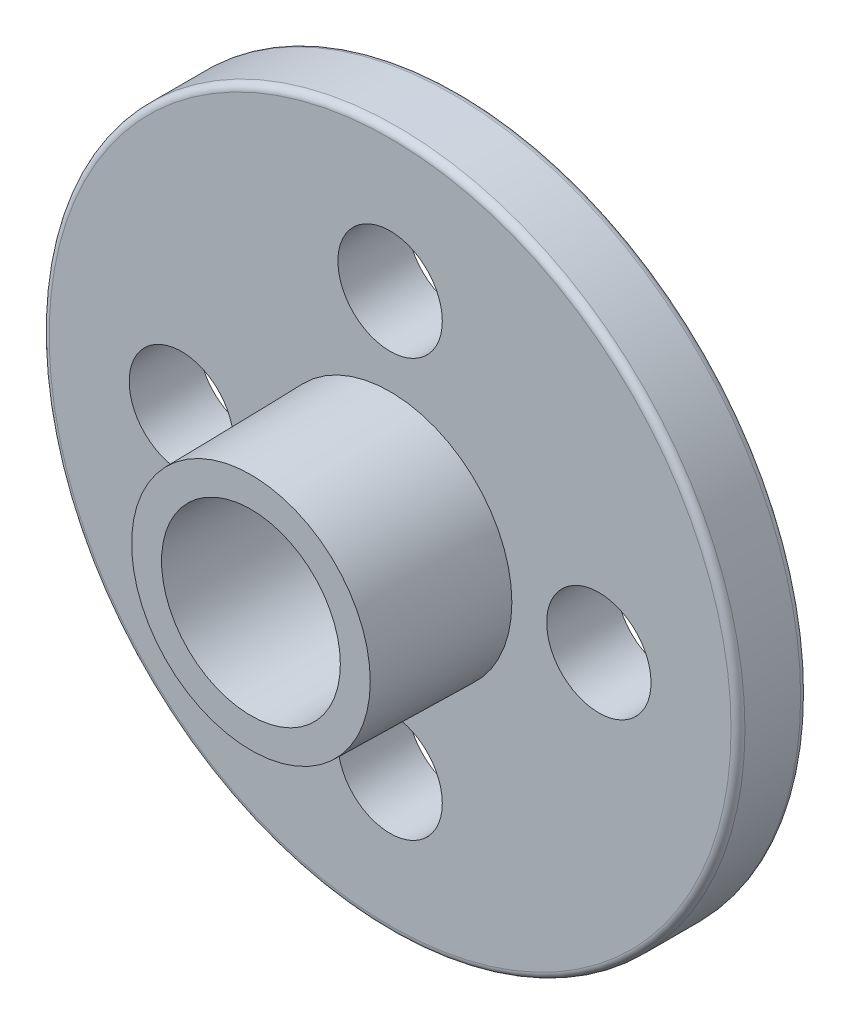
ISO-10303-21;
HEADER;
FILE_DESCRIPTION(('STEP AP214'),'2;1');
FILE_NAME('part.step','',(''),(''),'','','');
FILE_SCHEMA(('AUTOMOTIVE_DESIGN { 1 0 10303 214 1 1 1 1 }'));
ENDSEC;
DATA;
#1=APPLICATION_CONTEXT('core data for automotive mechanical design processes');
#2=APPLICATION_PROTOCOL_DEFINITION('international standard','automotive_design',2000,#1);
#3=PRODUCT_CONTEXT('',#1,'mechanical');
#4=PRODUCT('Part','Part','',(#3));
#5=PRODUCT_RELATED_PRODUCT_CATEGORY('part','',(#4));
#6=PRODUCT_DEFINITION_FORMATION('','',#4);
#7=PRODUCT_DEFINITION_CONTEXT('part definition',#1,'design');
#8=PRODUCT_DEFINITION('design','',#6,#7);
#9=PRODUCT_DEFINITION_SHAPE('','',#8);
#10=(LENGTH_UNIT() NAMED_UNIT(*) SI_UNIT(.MILLI.,.METRE.));
#11=(NAMED_UNIT(*) PLANE_ANGLE_UNIT() SI_UNIT($,.RADIAN.));
#12=(NAMED_UNIT(*) SI_UNIT($,.STERADIAN.) SOLID_ANGLE_UNIT());
#13=UNCERTAINTY_MEASURE_WITH_UNIT(LENGTH_MEASURE(1.E-05),#10,'distance_accuracy_value','');
#14=(GEOMETRIC_REPRESENTATION_CONTEXT(3) GLOBAL_UNCERTAINTY_ASSIGNED_CONTEXT((#13)) GLOBAL_UNIT_ASSIGNED_CONTEXT((#10,
#11,#12)) REPRESENTATION_CONTEXT('',''));
#15=CARTESIAN_POINT('',(0.,0.,0.));
#16=DIRECTION('',(0.,0.,1.));
#17=DIRECTION('',(1.,0.,0.));
#18=AXIS2_PLACEMENT_3D('',#15,#16,#17);
#19=CARTESIAN_POINT('',(0.,0.,2.));
#20=DIRECTION('',(0.,0.,1.));
#21=DIRECTION('',(1.,0.,0.));
#22=AXIS2_PLACEMENT_3D('',#19,#20,#21);
#23=PLANE('',#22);
#24=CARTESIAN_POINT('',(0.,0.,2.));
#25=DIRECTION('',(0.,0.,1.));
#26=DIRECTION('',(1.,0.,0.));
#27=AXIS2_PLACEMENT_3D('',#24,#25,#26);
#28=CIRCLE('',#27,3.5);
#29=CARTESIAN_POINT('',(3.5,0.,2.));
#30=VERTEX_POINT('',#29);
#31=EDGE_CURVE('E89',#30,#30,#28,.T.);
#32=ORIENTED_EDGE('',*,*,#31,.F.);
#33=EDGE_LOOP('',(#32));
#34=FACE_BOUND('',#33,.T.);
#35=CARTESIAN_POINT('',(0.,0.,2.));
#36=DIRECTION('',(0.,0.,1.));
#37=DIRECTION('',(1.,0.,0.));
#38=AXIS2_PLACEMENT_3D('',#35,#36,#37);
#39=CIRCLE('',#38,9.8);
#40=CARTESIAN_POINT('',(9.8,0.,2.));
#41=VERTEX_POINT('',#40);
#42=EDGE_CURVE('E46',#41,#41,#39,.T.);
#43=ORIENTED_EDGE('',*,*,#42,.T.);
#44=EDGE_LOOP('',(#43));
#45=FACE_BOUND('',#44,.T.);
#46=CARTESIAN_POINT('',(3.39346007646042E-13,-6.,2.));
#47=DIRECTION('',(0.,0.,1.));
#48=DIRECTION('',(1.,0.,0.));
#49=AXIS2_PLACEMENT_3D('',#46,#47,#48);
#50=CIRCLE('',#49,1.50000000000037);
#51=CARTESIAN_POINT('',(1.5000000000007,-6.,2.));
#52=VERTEX_POINT('',#51);
#53=EDGE_CURVE('E71',#52,#52,#50,.T.);
#54=ORIENTED_EDGE('',*,*,#53,.F.);
#55=EDGE_LOOP('',(#54));
#56=FACE_BOUND('',#55,.T.);
#57=CARTESIAN_POINT('',(0.,6.,2.));
#58=DIRECTION('',(0.,0.,1.));
#59=DIRECTION('',(1.,0.,0.));
#60=AXIS2_PLACEMENT_3D('',#57,#58,#59);
#61=CIRCLE('',#60,1.5);
#62=CARTESIAN_POINT('',(1.5,6.,2.));
#63=VERTEX_POINT('',#62);
#64=EDGE_CURVE('E61',#63,#63,#61,.T.);
#65=ORIENTED_EDGE('',*,*,#64,.F.);
#66=EDGE_LOOP('',(#65));
#67=FACE_BOUND('',#66,.T.);
#68=CARTESIAN_POINT('',(6.00000000000017,1.69428074463191E-13,2.));
#69=DIRECTION('',(0.,0.,1.));
#70=DIRECTION('',(1.,0.,0.));
#71=AXIS2_PLACEMENT_3D('',#68,#69,#70);
#72=CIRCLE('',#71,1.50000000000013);
#73=CARTESIAN_POINT('',(7.5000000000003,1.69428074463191E-13,2.));
#74=VERTEX_POINT('',#73);
#75=EDGE_CURVE('E65',#74,#74,#72,.T.);
#76=ORIENTED_EDGE('',*,*,#75,.F.);
#77=EDGE_LOOP('',(#76));
#78=FACE_BOUND('',#77,.T.);
#79=CARTESIAN_POINT('',(-5.99999999999983,-1.7016286254268E-13,2.));
#80=DIRECTION('',(0.,0.,1.));
#81=DIRECTION('',(1.,0.,0.));
#82=AXIS2_PLACEMENT_3D('',#79,#80,#81);
#83=CIRCLE('',#82,1.50000000000027);
#84=CARTESIAN_POINT('',(-4.49999999999956,-1.7016286254268E-13,2.));
#85=VERTEX_POINT('',#84);
#86=EDGE_CURVE('E77',#85,#85,#83,.T.);
#87=ORIENTED_EDGE('',*,*,#86,.F.);
#88=EDGE_LOOP('',(#87));
#89=FACE_BOUND('',#88,.T.);
#90=ADVANCED_FACE('F38',(#34,#45,#56,#67,#78,#89),#23,.T.);
#91=CARTESIAN_POINT('',(0.,0.,0.));
#92=DIRECTION('',(0.,0.,1.));
#93=DIRECTION('',(1.,0.,0.));
#94=AXIS2_PLACEMENT_3D('',#91,#92,#93);
#95=PLANE('',#94);
#96=CARTESIAN_POINT('',(0.,0.,0.));
#97=DIRECTION('',(0.,0.,-1.));
#98=DIRECTION('',(-1.,0.,0.));
#99=AXIS2_PLACEMENT_3D('',#96,#97,#98);
#100=CIRCLE('',#99,1.5);
#101=CARTESIAN_POINT('',(-1.5,0.,0.));
#102=VERTEX_POINT('',#101);
#103=EDGE_CURVE('E94',#102,#102,#100,.T.);
#104=ORIENTED_EDGE('',*,*,#103,.F.);
#105=EDGE_LOOP('',(#104));
#106=FACE_BOUND('',#105,.T.);
#107=CARTESIAN_POINT('',(0.,0.,0.));
#108=DIRECTION('',(0.,0.,1.));
#109=DIRECTION('',(1.,0.,0.));
#110=AXIS2_PLACEMENT_3D('',#107,#108,#109);
#111=CIRCLE('',#110,9.8);
#112=CARTESIAN_POINT('',(9.8,0.,0.));
#113=VERTEX_POINT('',#112);
#114=EDGE_CURVE('E50',#113,#113,#111,.F.);
#115=ORIENTED_EDGE('',*,*,#114,.T.);
#116=EDGE_LOOP('',(#115));
#117=FACE_BOUND('',#116,.T.);
#118=CARTESIAN_POINT('',(0.,6.,0.));
#119=DIRECTION('',(0.,0.,1.));
#120=DIRECTION('',(1.,0.,0.));
#121=AXIS2_PLACEMENT_3D('',#118,#119,#120);
#122=CIRCLE('',#121,1.5);
#123=CARTESIAN_POINT('',(1.5,6.,0.));
#124=VERTEX_POINT('',#123);
#125=EDGE_CURVE('E62',#124,#124,#122,.T.);
#126=ORIENTED_EDGE('',*,*,#125,.T.);
#127=EDGE_LOOP('',(#126));
#128=FACE_BOUND('',#127,.T.);
#129=CARTESIAN_POINT('',(6.00000000000017,1.69428074463191E-13,0.));
#130=DIRECTION('',(0.,0.,1.));
#131=DIRECTION('',(1.,0.,0.));
#132=AXIS2_PLACEMENT_3D('',#129,#130,#131);
#133=CIRCLE('',#132,1.50000000000013);
#134=CARTESIAN_POINT('',(7.5000000000003,1.69428074463191E-13,0.));
#135=VERTEX_POINT('',#134);
#136=EDGE_CURVE('E68',#135,#135,#133,.T.);
#137=ORIENTED_EDGE('',*,*,#136,.T.);
#138=EDGE_LOOP('',(#137));
#139=FACE_BOUND('',#138,.T.);
#140=CARTESIAN_POINT('',(3.39346007646042E-13,-6.,0.));
#141=DIRECTION('',(0.,0.,1.));
#142=DIRECTION('',(1.,0.,0.));
#143=AXIS2_PLACEMENT_3D('',#140,#141,#142);
#144=CIRCLE('',#143,1.50000000000037);
#145=CARTESIAN_POINT('',(1.5000000000007,-6.,0.));
#146=VERTEX_POINT('',#145);
#147=EDGE_CURVE('E74',#146,#146,#144,.T.);
#148=ORIENTED_EDGE('',*,*,#147,.T.);
#149=EDGE_LOOP('',(#148));
#150=FACE_BOUND('',#149,.T.);
#151=CARTESIAN_POINT('',(-5.99999999999983,-1.7016286254268E-13,0.));
#152=DIRECTION('',(0.,0.,1.));
#153=DIRECTION('',(1.,0.,0.));
#154=AXIS2_PLACEMENT_3D('',#151,#152,#153);
#155=CIRCLE('',#154,1.50000000000027);
#156=CARTESIAN_POINT('',(-4.49999999999956,-1.7016286254268E-13,0.));
#157=VERTEX_POINT('',#156);
#158=EDGE_CURVE('E80',#157,#157,#155,.T.);
#159=ORIENTED_EDGE('',*,*,#158,.T.);
#160=EDGE_LOOP('',(#159));
#161=FACE_BOUND('',#160,.T.);
#162=ADVANCED_FACE('F119',(#106,#117,#128,#139,#150,#161),#95,.F.);
#163=CARTESIAN_POINT('',(0.,0.,2.));
#164=DIRECTION('',(0.,0.,-1.));
#165=DIRECTION('',(-1.,0.,0.));
#166=AXIS2_PLACEMENT_3D('',#163,#164,#165);
#167=CYLINDRICAL_SURFACE('',#166,10.);
#168=CARTESIAN_POINT('',(0.,0.,0.2));
#169=DIRECTION('',(0.,0.,1.));
#170=DIRECTION('',(1.,0.,0.));
#171=AXIS2_PLACEMENT_3D('',#168,#169,#170);
#172=CIRCLE('',#171,10.);
#173=CARTESIAN_POINT('',(10.,0.,0.2));
#174=VERTEX_POINT('',#173);
#175=EDGE_CURVE('E55',#174,#174,#172,.T.);
#176=ORIENTED_EDGE('',*,*,#175,.T.);
#177=EDGE_LOOP('',(#176));
#178=FACE_BOUND('',#177,.T.);
#179=CARTESIAN_POINT('',(0.,0.,1.8));
#180=DIRECTION('',(0.,0.,1.));
#181=DIRECTION('',(1.,0.,0.));
#182=AXIS2_PLACEMENT_3D('',#179,#180,#181);
#183=CIRCLE('',#182,10.);
#184=CARTESIAN_POINT('',(10.,0.,1.8));
#185=VERTEX_POINT('',#184);
#186=EDGE_CURVE('E58',#185,#185,#183,.F.);
#187=ORIENTED_EDGE('',*,*,#186,.T.);
#188=EDGE_LOOP('',(#187));
#189=FACE_BOUND('',#188,.T.);
#190=ADVANCED_FACE('F124',(#178,#189),#167,.T.);
#191=CARTESIAN_POINT('',(0.,6.,2.));
#192=DIRECTION('',(0.,0.,-1.));
#193=DIRECTION('',(-1.,0.,0.));
#194=AXIS2_PLACEMENT_3D('',#191,#192,#193);
#195=CYLINDRICAL_SURFACE('',#194,1.5);
#196=ORIENTED_EDGE('',*,*,#64,.T.);
#197=EDGE_LOOP('',(#196));
#198=FACE_BOUND('',#197,.T.);
#199=ORIENTED_EDGE('',*,*,#125,.F.);
#200=EDGE_LOOP('',(#199));
#201=FACE_BOUND('',#200,.T.);
#202=ADVANCED_FACE('F157',(#198,#201),#195,.F.);
#203=CARTESIAN_POINT('',(6.00000000000017,1.69428074463191E-13,2.));
#204=DIRECTION('',(0.,0.,-1.));
#205=DIRECTION('',(-1.,0.,0.));
#206=AXIS2_PLACEMENT_3D('',#203,#204,#205);
#207=CYLINDRICAL_SURFACE('',#206,1.50000000000013);
#208=ORIENTED_EDGE('',*,*,#75,.T.);
#209=EDGE_LOOP('',(#208));
#210=FACE_BOUND('',#209,.T.);
#211=ORIENTED_EDGE('',*,*,#136,.F.);
#212=EDGE_LOOP('',(#211));
#213=FACE_BOUND('',#212,.T.);
#214=ADVANCED_FACE('F151',(#210,#213),#207,.F.);
#215=CARTESIAN_POINT('',(3.39346007646042E-13,-6.,2.));
#216=DIRECTION('',(0.,0.,-1.));
#217=DIRECTION('',(-1.,0.,0.));
#218=AXIS2_PLACEMENT_3D('',#215,#216,#217);
#219=CYLINDRICAL_SURFACE('',#218,1.50000000000037);
#220=ORIENTED_EDGE('',*,*,#53,.T.);
#221=EDGE_LOOP('',(#220));
#222=FACE_BOUND('',#221,.T.);
#223=ORIENTED_EDGE('',*,*,#147,.F.);
#224=EDGE_LOOP('',(#223));
#225=FACE_BOUND('',#224,.T.);
#226=ADVANCED_FACE('F142',(#222,#225),#219,.F.);
#227=CARTESIAN_POINT('',(-5.99999999999983,-1.7016286254268E-13,2.));
#228=DIRECTION('',(0.,0.,-1.));
#229=DIRECTION('',(-1.,0.,0.));
#230=AXIS2_PLACEMENT_3D('',#227,#228,#229);
#231=CYLINDRICAL_SURFACE('',#230,1.50000000000027);
#232=ORIENTED_EDGE('',*,*,#86,.T.);
#233=EDGE_LOOP('',(#232));
#234=FACE_BOUND('',#233,.T.);
#235=ORIENTED_EDGE('',*,*,#158,.F.);
#236=EDGE_LOOP('',(#235));
#237=FACE_BOUND('',#236,.T.);
#238=ADVANCED_FACE('F138',(#234,#237),#231,.F.);
#239=CARTESIAN_POINT('',(0.,0.,0.2));
#240=DIRECTION('',(0.,0.,1.));
#241=DIRECTION('',(1.,0.,0.));
#242=AXIS2_PLACEMENT_3D('',#239,#240,#241);
#243=TOROIDAL_SURFACE('',#242,9.8,0.2);
#244=ORIENTED_EDGE('',*,*,#114,.F.);
#245=EDGE_LOOP('',(#244));
#246=FACE_BOUND('',#245,.T.);
#247=ORIENTED_EDGE('',*,*,#175,.F.);
#248=EDGE_LOOP('',(#247));
#249=FACE_BOUND('',#248,.T.);
#250=ADVANCED_FACE('F141',(#246,#249),#243,.T.);
#251=CARTESIAN_POINT('',(0.,0.,1.8));
#252=DIRECTION('',(0.,0.,1.));
#253=DIRECTION('',(1.,0.,0.));
#254=AXIS2_PLACEMENT_3D('',#251,#252,#253);
#255=TOROIDAL_SURFACE('',#254,9.8,0.2);
#256=ORIENTED_EDGE('',*,*,#186,.F.);
#257=EDGE_LOOP('',(#256));
#258=FACE_BOUND('',#257,.T.);
#259=ORIENTED_EDGE('',*,*,#42,.F.);
#260=EDGE_LOOP('',(#259));
#261=FACE_BOUND('',#260,.T.);
#262=ADVANCED_FACE('F40',(#258,#261),#255,.T.);
#263=CARTESIAN_POINT('',(0.,0.,6.));
#264=DIRECTION('',(0.,0.,1.));
#265=DIRECTION('',(1.,0.,0.));
#266=AXIS2_PLACEMENT_3D('',#263,#264,#265);
#267=PLANE('',#266);
#268=CARTESIAN_POINT('',(0.,0.,6.));
#269=DIRECTION('',(0.,0.,1.));
#270=DIRECTION('',(1.,0.,0.));
#271=AXIS2_PLACEMENT_3D('',#268,#269,#270);
#272=CIRCLE('',#271,3.43017974028713);
#273=CARTESIAN_POINT('',(3.43017974028713,0.,6.));
#274=VERTEX_POINT('',#273);
#275=EDGE_CURVE('E83',#274,#274,#272,.T.);
#276=ORIENTED_EDGE('',*,*,#275,.T.);
#277=EDGE_LOOP('',(#276));
#278=FACE_BOUND('',#277,.T.);
#279=CARTESIAN_POINT('',(0.,0.,6.));
#280=DIRECTION('',(0.,0.,1.));
#281=DIRECTION('',(1.,0.,0.));
#282=AXIS2_PLACEMENT_3D('',#279,#280,#281);
#283=CIRCLE('',#282,2.56982025971287);
#284=CARTESIAN_POINT('',(2.56982025971287,0.,6.));
#285=VERTEX_POINT('',#284);
#286=EDGE_CURVE('E86',#285,#285,#283,.T.);
#287=ORIENTED_EDGE('',*,*,#286,.F.);
#288=EDGE_LOOP('',(#287));
#289=FACE_BOUND('',#288,.T.);
#290=ADVANCED_FACE('F183',(#278,#289),#267,.T.);
#291=CARTESIAN_POINT('',(0.,0.,2.));
#292=DIRECTION('',(0.,0.,-1.));
#293=DIRECTION('',(1.,0.,0.));
#294=AXIS2_PLACEMENT_3D('',#291,#292,#293);
#295=CONICAL_SURFACE('',#294,3.5,0.0174532925199433);
#296=ORIENTED_EDGE('',*,*,#275,.F.);
#297=EDGE_LOOP('',(#296));
#298=FACE_BOUND('',#297,.T.);
#299=ORIENTED_EDGE('',*,*,#31,.T.);
#300=EDGE_LOOP('',(#299));
#301=FACE_BOUND('',#300,.T.);
#302=ADVANCED_FACE('F113',(#298,#301),#295,.T.);
#303=CARTESIAN_POINT('',(0.,0.,2.));
#304=DIRECTION('',(0.,0.,1.));
#305=DIRECTION('',(1.,0.,0.));
#306=AXIS2_PLACEMENT_3D('',#303,#304,#305);
#307=CONICAL_SURFACE('',#306,2.5,0.0174532925199433);
#308=ORIENTED_EDGE('',*,*,#286,.T.);
#309=EDGE_LOOP('',(#308));
#310=FACE_BOUND('',#309,.T.);
#311=CARTESIAN_POINT('',(0.,0.,2.));
#312=DIRECTION('',(0.,0.,1.));
#313=DIRECTION('',(1.,0.,0.));
#314=AXIS2_PLACEMENT_3D('',#311,#312,#313);
#315=CIRCLE('',#314,2.5);
#316=CARTESIAN_POINT('',(2.5,0.,2.));
#317=VERTEX_POINT('',#316);
#318=EDGE_CURVE('E10',#317,#317,#315,.F.);
#319=ORIENTED_EDGE('',*,*,#318,.T.);
#320=EDGE_LOOP('',(#319));
#321=FACE_BOUND('',#320,.T.);
#322=ADVANCED_FACE('F106',(#310,#321),#307,.F.);
#323=CARTESIAN_POINT('',(0.,0.,2.));
#324=DIRECTION('',(0.,0.,1.));
#325=DIRECTION('',(1.,0.,0.));
#326=AXIS2_PLACEMENT_3D('',#323,#324,#325);
#327=CIRCLE('',#326,1.5);
#328=CARTESIAN_POINT('',(1.5,0.,2.));
#329=VERTEX_POINT('',#328);
#330=EDGE_CURVE('E42',#329,#329,#327,.T.);
#331=ORIENTED_EDGE('',*,*,#330,.F.);
#332=EDGE_LOOP('',(#331));
#333=FACE_BOUND('',#332,.T.);
#334=ORIENTED_EDGE('',*,*,#318,.F.);
#335=EDGE_LOOP('',(#334));
#336=FACE_BOUND('',#335,.T.);
#337=ADVANCED_FACE('F103',(#333,#336),#23,.T.);
#338=CARTESIAN_POINT('',(0.,0.,4.));
#339=DIRECTION('',(0.,0.,-1.));
#340=DIRECTION('',(-1.,0.,0.));
#341=AXIS2_PLACEMENT_3D('',#338,#339,#340);
#342=CYLINDRICAL_SURFACE('',#341,1.5);
#343=ORIENTED_EDGE('',*,*,#330,.T.);
#344=EDGE_LOOP('',(#343));
#345=FACE_BOUND('',#344,.T.);
#346=ORIENTED_EDGE('',*,*,#103,.T.);
#347=EDGE_LOOP('',(#346));
#348=FACE_BOUND('',#347,.T.);
#349=ADVANCED_FACE('F101',(#345,#348),#342,.F.);
#350=CLOSED_SHELL('',(#90,#162,#190,#202,#214,#226,#238,#250,#262,#290,#302,#322,#337,#349));
#351=MANIFOLD_SOLID_BREP('B2',#350);
#352=ADVANCED_BREP_SHAPE_REPRESENTATION('',(#18,#351),#14);
#353=SHAPE_DEFINITION_REPRESENTATION(#9,#352);
ENDSEC;
END-ISO-10303-21;
